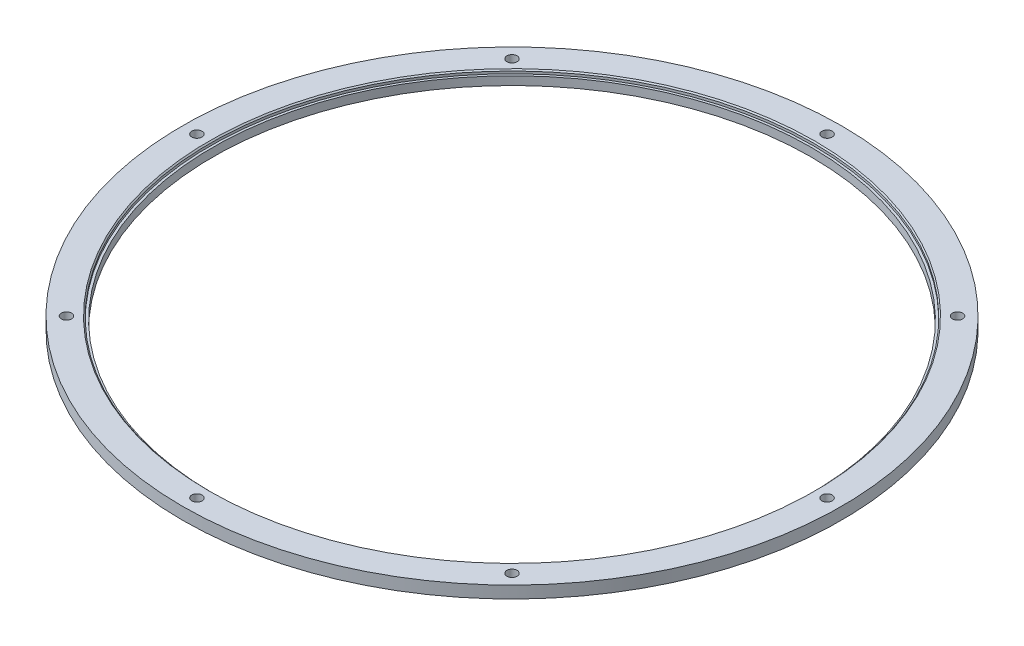
ISO-10303-21;
HEADER;
FILE_DESCRIPTION(('STEP AP214'),'2;1');
FILE_NAME('part.step','',(''),(''),'','','');
FILE_SCHEMA(('AUTOMOTIVE_DESIGN { 1 0 10303 214 1 1 1 1 }'));
ENDSEC;
DATA;
#1=APPLICATION_CONTEXT('core data for automotive mechanical design processes');
#2=APPLICATION_PROTOCOL_DEFINITION('international standard','automotive_design',2000,#1);
#3=PRODUCT_CONTEXT('',#1,'mechanical');
#4=PRODUCT('Part','Part','',(#3));
#5=PRODUCT_RELATED_PRODUCT_CATEGORY('part','',(#4));
#6=PRODUCT_DEFINITION_FORMATION('','',#4);
#7=PRODUCT_DEFINITION_CONTEXT('part definition',#1,'design');
#8=PRODUCT_DEFINITION('design','',#6,#7);
#9=PRODUCT_DEFINITION_SHAPE('','',#8);
#10=(LENGTH_UNIT() NAMED_UNIT(*) SI_UNIT(.MILLI.,.METRE.));
#11=(NAMED_UNIT(*) PLANE_ANGLE_UNIT() SI_UNIT($,.RADIAN.));
#12=(NAMED_UNIT(*) SI_UNIT($,.STERADIAN.) SOLID_ANGLE_UNIT());
#13=UNCERTAINTY_MEASURE_WITH_UNIT(LENGTH_MEASURE(1.E-05),#10,'distance_accuracy_value','');
#14=(GEOMETRIC_REPRESENTATION_CONTEXT(3) GLOBAL_UNCERTAINTY_ASSIGNED_CONTEXT((#13)) GLOBAL_UNIT_ASSIGNED_CONTEXT((#10,
#11,#12)) REPRESENTATION_CONTEXT('',''));
#15=CARTESIAN_POINT('',(0.,0.,0.));
#16=DIRECTION('',(0.,0.,1.));
#17=DIRECTION('',(1.,0.,0.));
#18=AXIS2_PLACEMENT_3D('',#15,#16,#17);
#19=CARTESIAN_POINT('',(0.,10.,0.));
#20=DIRECTION('',(0.,-1.,0.));
#21=DIRECTION('',(0.,0.,-1.));
#22=AXIS2_PLACEMENT_3D('',#19,#20,#21);
#23=CYLINDRICAL_SURFACE('',#22,248.);
#24=CARTESIAN_POINT('',(0.,0.,0.));
#25=DIRECTION('',(0.,1.,0.));
#26=DIRECTION('',(0.,0.,1.));
#27=AXIS2_PLACEMENT_3D('',#24,#25,#26);
#28=CIRCLE('',#27,248.);
#29=CARTESIAN_POINT('',(0.,0.,248.));
#30=VERTEX_POINT('',#29);
#31=EDGE_CURVE('E63',#30,#30,#28,.T.);
#32=ORIENTED_EDGE('',*,*,#31,.F.);
#33=EDGE_LOOP('',(#32));
#34=FACE_BOUND('',#33,.T.);
#35=CARTESIAN_POINT('',(0.,7.,0.));
#36=DIRECTION('',(0.,1.,0.));
#37=DIRECTION('',(0.,0.,1.));
#38=AXIS2_PLACEMENT_3D('',#35,#36,#37);
#39=CIRCLE('',#38,248.);
#40=CARTESIAN_POINT('',(0.,7.,248.));
#41=VERTEX_POINT('',#40);
#42=EDGE_CURVE('E57',#41,#41,#39,.T.);
#43=ORIENTED_EDGE('',*,*,#42,.T.);
#44=EDGE_LOOP('',(#43));
#45=FACE_BOUND('',#44,.T.);
#46=ADVANCED_FACE('F39',(#34,#45),#23,.F.);
#47=CARTESIAN_POINT('',(0.,10.,0.));
#48=DIRECTION('',(0.,1.,0.));
#49=DIRECTION('',(0.,0.,1.));
#50=AXIS2_PLACEMENT_3D('',#47,#48,#49);
#51=PLANE('',#50);
#52=CARTESIAN_POINT('',(0.,10.,0.));
#53=DIRECTION('',(0.,1.,0.));
#54=DIRECTION('',(0.,0.,1.));
#55=AXIS2_PLACEMENT_3D('',#52,#53,#54);
#56=CIRCLE('',#55,251.);
#57=CARTESIAN_POINT('',(0.,10.,251.));
#58=VERTEX_POINT('',#57);
#59=EDGE_CURVE('E10',#58,#58,#56,.F.);
#60=ORIENTED_EDGE('',*,*,#59,.T.);
#61=EDGE_LOOP('',(#60));
#62=FACE_BOUND('',#61,.T.);
#63=CARTESIAN_POINT('',(-260.999999999971,10.,2.86353058293568E-11));
#64=DIRECTION('',(0.,1.,0.));
#65=DIRECTION('',(0.,0.,1.));
#66=AXIS2_PLACEMENT_3D('',#63,#64,#65);
#67=CIRCLE('',#66,4.24999999999995);
#68=CARTESIAN_POINT('',(-260.999999999971,10.,4.25000000002859));
#69=VERTEX_POINT('',#68);
#70=EDGE_CURVE('E101',#69,#69,#67,.T.);
#71=ORIENTED_EDGE('',*,*,#70,.F.);
#72=EDGE_LOOP('',(#71));
#73=FACE_BOUND('',#72,.T.);
#74=CARTESIAN_POINT('',(5.72066850957982E-11,10.,261.));
#75=DIRECTION('',(0.,1.,0.));
#76=DIRECTION('',(0.,0.,1.));
#77=AXIS2_PLACEMENT_3D('',#74,#75,#76);
#78=CIRCLE('',#77,4.25);
#79=CARTESIAN_POINT('',(5.72066850957982E-11,10.,265.25));
#80=VERTEX_POINT('',#79);
#81=EDGE_CURVE('E89',#80,#80,#78,.T.);
#82=ORIENTED_EDGE('',*,*,#81,.F.);
#83=EDGE_LOOP('',(#82));
#84=FACE_BOUND('',#83,.T.);
#85=CARTESIAN_POINT('',(261.000000000029,10.,-2.86033425478991E-11));
#86=DIRECTION('',(0.,1.,0.));
#87=DIRECTION('',(0.,0.,1.));
#88=AXIS2_PLACEMENT_3D('',#85,#86,#87);
#89=CIRCLE('',#88,4.24999999999995);
#90=CARTESIAN_POINT('',(261.000000000029,10.,4.24999999997135));
#91=VERTEX_POINT('',#90);
#92=EDGE_CURVE('E77',#91,#91,#89,.T.);
#93=ORIENTED_EDGE('',*,*,#92,.F.);
#94=EDGE_LOOP('',(#93));
#95=FACE_BOUND('',#94,.T.);
#96=CARTESIAN_POINT('',(0.,10.,-261.));
#97=DIRECTION('',(0.,1.,0.));
#98=DIRECTION('',(0.,0.,1.));
#99=AXIS2_PLACEMENT_3D('',#96,#97,#98);
#100=CIRCLE('',#99,4.25);
#101=CARTESIAN_POINT('',(0.,10.,-256.75));
#102=VERTEX_POINT('',#101);
#103=EDGE_CURVE('E67',#102,#102,#100,.T.);
#104=ORIENTED_EDGE('',*,*,#103,.F.);
#105=EDGE_LOOP('',(#104));
#106=FACE_BOUND('',#105,.T.);
#107=CARTESIAN_POINT('',(0.,10.,0.));
#108=DIRECTION('',(0.,1.,0.));
#109=DIRECTION('',(0.,0.,1.));
#110=AXIS2_PLACEMENT_3D('',#107,#108,#109);
#111=CIRCLE('',#110,273.);
#112=CARTESIAN_POINT('',(0.,10.,273.));
#113=VERTEX_POINT('',#112);
#114=EDGE_CURVE('E50',#113,#113,#111,.T.);
#115=ORIENTED_EDGE('',*,*,#114,.T.);
#116=EDGE_LOOP('',(#115));
#117=FACE_BOUND('',#116,.T.);
#118=CARTESIAN_POINT('',(184.554869889697,10.,-184.554869889709));
#119=DIRECTION('',(0.,1.,0.));
#120=DIRECTION('',(0.,0.,1.));
#121=AXIS2_PLACEMENT_3D('',#118,#119,#120);
#122=CIRCLE('',#121,4.25000000000001);
#123=CARTESIAN_POINT('',(184.554869889697,10.,-180.304869889709));
#124=VERTEX_POINT('',#123);
#125=EDGE_CURVE('E71',#124,#124,#122,.T.);
#126=ORIENTED_EDGE('',*,*,#125,.F.);
#127=EDGE_LOOP('',(#126));
#128=FACE_BOUND('',#127,.T.);
#129=CARTESIAN_POINT('',(184.554869889738,10.,184.554869889669));
#130=DIRECTION('',(0.,1.,0.));
#131=DIRECTION('',(0.,0.,1.));
#132=AXIS2_PLACEMENT_3D('',#129,#130,#131);
#133=CIRCLE('',#132,4.25000000000001);
#134=CARTESIAN_POINT('',(184.554869889738,10.,188.804869889669));
#135=VERTEX_POINT('',#134);
#136=EDGE_CURVE('E83',#135,#135,#133,.T.);
#137=ORIENTED_EDGE('',*,*,#136,.F.);
#138=EDGE_LOOP('',(#137));
#139=FACE_BOUND('',#138,.T.);
#140=CARTESIAN_POINT('',(-184.55486988964,10.,184.554869889709));
#141=DIRECTION('',(0.,1.,0.));
#142=DIRECTION('',(0.,0.,1.));
#143=AXIS2_PLACEMENT_3D('',#140,#141,#142);
#144=CIRCLE('',#143,4.25000000000001);
#145=CARTESIAN_POINT('',(-184.55486988964,10.,188.804869889709));
#146=VERTEX_POINT('',#145);
#147=EDGE_CURVE('E95',#146,#146,#144,.T.);
#148=ORIENTED_EDGE('',*,*,#147,.F.);
#149=EDGE_LOOP('',(#148));
#150=FACE_BOUND('',#149,.T.);
#151=CARTESIAN_POINT('',(-184.554869889681,10.,-184.554869889669));
#152=DIRECTION('',(0.,1.,0.));
#153=DIRECTION('',(0.,0.,1.));
#154=AXIS2_PLACEMENT_3D('',#151,#152,#153);
#155=CIRCLE('',#154,4.25000000000001);
#156=CARTESIAN_POINT('',(-184.554869889681,10.,-180.304869889669));
#157=VERTEX_POINT('',#156);
#158=EDGE_CURVE('E107',#157,#157,#155,.T.);
#159=ORIENTED_EDGE('',*,*,#158,.F.);
#160=EDGE_LOOP('',(#159));
#161=FACE_BOUND('',#160,.T.);
#162=ADVANCED_FACE('F133',(#62,#73,#84,#95,#106,#117,#128,#139,#150,#161),#51,.T.);
#163=CARTESIAN_POINT('',(0.,0.,0.));
#164=DIRECTION('',(0.,1.,0.));
#165=DIRECTION('',(0.,0.,1.));
#166=AXIS2_PLACEMENT_3D('',#163,#164,#165);
#167=PLANE('',#166);
#168=CARTESIAN_POINT('',(0.,0.,0.));
#169=DIRECTION('',(0.,1.,0.));
#170=DIRECTION('',(0.,0.,1.));
#171=AXIS2_PLACEMENT_3D('',#168,#169,#170);
#172=CIRCLE('',#171,273.);
#173=CARTESIAN_POINT('',(0.,0.,273.));
#174=VERTEX_POINT('',#173);
#175=EDGE_CURVE('E54',#174,#174,#172,.T.);
#176=ORIENTED_EDGE('',*,*,#175,.F.);
#177=EDGE_LOOP('',(#176));
#178=FACE_BOUND('',#177,.T.);
#179=ORIENTED_EDGE('',*,*,#31,.T.);
#180=EDGE_LOOP('',(#179));
#181=FACE_BOUND('',#180,.T.);
#182=CARTESIAN_POINT('',(0.,0.,-261.));
#183=DIRECTION('',(0.,1.,0.));
#184=DIRECTION('',(0.,0.,1.));
#185=AXIS2_PLACEMENT_3D('',#182,#183,#184);
#186=CIRCLE('',#185,4.25);
#187=CARTESIAN_POINT('',(0.,0.,-256.75));
#188=VERTEX_POINT('',#187);
#189=EDGE_CURVE('E68',#188,#188,#186,.T.);
#190=ORIENTED_EDGE('',*,*,#189,.T.);
#191=EDGE_LOOP('',(#190));
#192=FACE_BOUND('',#191,.T.);
#193=CARTESIAN_POINT('',(184.554869889697,0.,-184.554869889709));
#194=DIRECTION('',(0.,1.,0.));
#195=DIRECTION('',(0.,0.,1.));
#196=AXIS2_PLACEMENT_3D('',#193,#194,#195);
#197=CIRCLE('',#196,4.25000000000001);
#198=CARTESIAN_POINT('',(184.554869889697,0.,-180.304869889709));
#199=VERTEX_POINT('',#198);
#200=EDGE_CURVE('E74',#199,#199,#197,.T.);
#201=ORIENTED_EDGE('',*,*,#200,.T.);
#202=EDGE_LOOP('',(#201));
#203=FACE_BOUND('',#202,.T.);
#204=CARTESIAN_POINT('',(261.000000000029,0.,-2.86033425478991E-11));
#205=DIRECTION('',(0.,1.,0.));
#206=DIRECTION('',(0.,0.,1.));
#207=AXIS2_PLACEMENT_3D('',#204,#205,#206);
#208=CIRCLE('',#207,4.24999999999995);
#209=CARTESIAN_POINT('',(261.000000000029,0.,4.24999999997135));
#210=VERTEX_POINT('',#209);
#211=EDGE_CURVE('E80',#210,#210,#208,.T.);
#212=ORIENTED_EDGE('',*,*,#211,.T.);
#213=EDGE_LOOP('',(#212));
#214=FACE_BOUND('',#213,.T.);
#215=CARTESIAN_POINT('',(184.554869889738,0.,184.554869889669));
#216=DIRECTION('',(0.,1.,0.));
#217=DIRECTION('',(0.,0.,1.));
#218=AXIS2_PLACEMENT_3D('',#215,#216,#217);
#219=CIRCLE('',#218,4.25000000000001);
#220=CARTESIAN_POINT('',(184.554869889738,0.,188.804869889669));
#221=VERTEX_POINT('',#220);
#222=EDGE_CURVE('E86',#221,#221,#219,.T.);
#223=ORIENTED_EDGE('',*,*,#222,.T.);
#224=EDGE_LOOP('',(#223));
#225=FACE_BOUND('',#224,.T.);
#226=CARTESIAN_POINT('',(5.72066850957982E-11,0.,261.));
#227=DIRECTION('',(0.,1.,0.));
#228=DIRECTION('',(0.,0.,1.));
#229=AXIS2_PLACEMENT_3D('',#226,#227,#228);
#230=CIRCLE('',#229,4.25);
#231=CARTESIAN_POINT('',(5.72066850957982E-11,0.,265.25));
#232=VERTEX_POINT('',#231);
#233=EDGE_CURVE('E92',#232,#232,#230,.T.);
#234=ORIENTED_EDGE('',*,*,#233,.T.);
#235=EDGE_LOOP('',(#234));
#236=FACE_BOUND('',#235,.T.);
#237=CARTESIAN_POINT('',(-184.55486988964,0.,184.554869889709));
#238=DIRECTION('',(0.,1.,0.));
#239=DIRECTION('',(0.,0.,1.));
#240=AXIS2_PLACEMENT_3D('',#237,#238,#239);
#241=CIRCLE('',#240,4.25000000000001);
#242=CARTESIAN_POINT('',(-184.55486988964,0.,188.804869889709));
#243=VERTEX_POINT('',#242);
#244=EDGE_CURVE('E98',#243,#243,#241,.T.);
#245=ORIENTED_EDGE('',*,*,#244,.T.);
#246=EDGE_LOOP('',(#245));
#247=FACE_BOUND('',#246,.T.);
#248=CARTESIAN_POINT('',(-260.999999999971,0.,2.86353058293568E-11));
#249=DIRECTION('',(0.,1.,0.));
#250=DIRECTION('',(0.,0.,1.));
#251=AXIS2_PLACEMENT_3D('',#248,#249,#250);
#252=CIRCLE('',#251,4.24999999999995);
#253=CARTESIAN_POINT('',(-260.999999999971,0.,4.25000000002859));
#254=VERTEX_POINT('',#253);
#255=EDGE_CURVE('E104',#254,#254,#252,.T.);
#256=ORIENTED_EDGE('',*,*,#255,.T.);
#257=EDGE_LOOP('',(#256));
#258=FACE_BOUND('',#257,.T.);
#259=CARTESIAN_POINT('',(-184.554869889681,0.,-184.554869889669));
#260=DIRECTION('',(0.,1.,0.));
#261=DIRECTION('',(0.,0.,1.));
#262=AXIS2_PLACEMENT_3D('',#259,#260,#261);
#263=CIRCLE('',#262,4.25000000000001);
#264=CARTESIAN_POINT('',(-184.554869889681,0.,-180.304869889669));
#265=VERTEX_POINT('',#264);
#266=EDGE_CURVE('E60',#265,#265,#263,.T.);
#267=ORIENTED_EDGE('',*,*,#266,.T.);
#268=EDGE_LOOP('',(#267));
#269=FACE_BOUND('',#268,.T.);
#270=ADVANCED_FACE('F139',(#178,#181,#192,#203,#214,#225,#236,#247,#258,#269),#167,.F.);
#271=CARTESIAN_POINT('',(0.,10.,0.));
#272=DIRECTION('',(0.,-1.,0.));
#273=DIRECTION('',(0.,0.,-1.));
#274=AXIS2_PLACEMENT_3D('',#271,#272,#273);
#275=CYLINDRICAL_SURFACE('',#274,273.);
#276=ORIENTED_EDGE('',*,*,#114,.F.);
#277=EDGE_LOOP('',(#276));
#278=FACE_BOUND('',#277,.T.);
#279=ORIENTED_EDGE('',*,*,#175,.T.);
#280=EDGE_LOOP('',(#279));
#281=FACE_BOUND('',#280,.T.);
#282=ADVANCED_FACE('F148',(#278,#281),#275,.T.);
#283=CARTESIAN_POINT('',(0.,10.,-261.));
#284=DIRECTION('',(0.,-1.,0.));
#285=DIRECTION('',(0.,0.,-1.));
#286=AXIS2_PLACEMENT_3D('',#283,#284,#285);
#287=CYLINDRICAL_SURFACE('',#286,4.25);
#288=ORIENTED_EDGE('',*,*,#103,.T.);
#289=EDGE_LOOP('',(#288));
#290=FACE_BOUND('',#289,.T.);
#291=ORIENTED_EDGE('',*,*,#189,.F.);
#292=EDGE_LOOP('',(#291));
#293=FACE_BOUND('',#292,.T.);
#294=ADVANCED_FACE('F144',(#290,#293),#287,.F.);
#295=CARTESIAN_POINT('',(184.554869889697,10.,-184.554869889709));
#296=DIRECTION('',(0.,-1.,0.));
#297=DIRECTION('',(0.,0.,-1.));
#298=AXIS2_PLACEMENT_3D('',#295,#296,#297);
#299=CYLINDRICAL_SURFACE('',#298,4.25000000000001);
#300=ORIENTED_EDGE('',*,*,#125,.T.);
#301=EDGE_LOOP('',(#300));
#302=FACE_BOUND('',#301,.T.);
#303=ORIENTED_EDGE('',*,*,#200,.F.);
#304=EDGE_LOOP('',(#303));
#305=FACE_BOUND('',#304,.T.);
#306=ADVANCED_FACE('F155',(#302,#305),#299,.F.);
#307=CARTESIAN_POINT('',(261.000000000029,10.,-2.86033425478991E-11));
#308=DIRECTION('',(0.,-1.,0.));
#309=DIRECTION('',(0.,0.,-1.));
#310=AXIS2_PLACEMENT_3D('',#307,#308,#309);
#311=CYLINDRICAL_SURFACE('',#310,4.24999999999995);
#312=ORIENTED_EDGE('',*,*,#92,.T.);
#313=EDGE_LOOP('',(#312));
#314=FACE_BOUND('',#313,.T.);
#315=ORIENTED_EDGE('',*,*,#211,.F.);
#316=EDGE_LOOP('',(#315));
#317=FACE_BOUND('',#316,.T.);
#318=ADVANCED_FACE('F196',(#314,#317),#311,.F.);
#319=CARTESIAN_POINT('',(184.554869889738,10.,184.554869889669));
#320=DIRECTION('',(0.,-1.,0.));
#321=DIRECTION('',(0.,0.,-1.));
#322=AXIS2_PLACEMENT_3D('',#319,#320,#321);
#323=CYLINDRICAL_SURFACE('',#322,4.25000000000001);
#324=ORIENTED_EDGE('',*,*,#136,.T.);
#325=EDGE_LOOP('',(#324));
#326=FACE_BOUND('',#325,.T.);
#327=ORIENTED_EDGE('',*,*,#222,.F.);
#328=EDGE_LOOP('',(#327));
#329=FACE_BOUND('',#328,.T.);
#330=ADVANCED_FACE('F192',(#326,#329),#323,.F.);
#331=CARTESIAN_POINT('',(5.72066850957982E-11,10.,261.));
#332=DIRECTION('',(0.,-1.,0.));
#333=DIRECTION('',(0.,0.,-1.));
#334=AXIS2_PLACEMENT_3D('',#331,#332,#333);
#335=CYLINDRICAL_SURFACE('',#334,4.25);
#336=ORIENTED_EDGE('',*,*,#81,.T.);
#337=EDGE_LOOP('',(#336));
#338=FACE_BOUND('',#337,.T.);
#339=ORIENTED_EDGE('',*,*,#233,.F.);
#340=EDGE_LOOP('',(#339));
#341=FACE_BOUND('',#340,.T.);
#342=ADVANCED_FACE('F186',(#338,#341),#335,.F.);
#343=CARTESIAN_POINT('',(-184.55486988964,10.,184.554869889709));
#344=DIRECTION('',(0.,-1.,0.));
#345=DIRECTION('',(0.,0.,-1.));
#346=AXIS2_PLACEMENT_3D('',#343,#344,#345);
#347=CYLINDRICAL_SURFACE('',#346,4.25000000000001);
#348=ORIENTED_EDGE('',*,*,#147,.T.);
#349=EDGE_LOOP('',(#348));
#350=FACE_BOUND('',#349,.T.);
#351=ORIENTED_EDGE('',*,*,#244,.F.);
#352=EDGE_LOOP('',(#351));
#353=FACE_BOUND('',#352,.T.);
#354=ADVANCED_FACE('F180',(#350,#353),#347,.F.);
#355=CARTESIAN_POINT('',(-260.999999999971,10.,2.86353058293568E-11));
#356=DIRECTION('',(0.,-1.,0.));
#357=DIRECTION('',(0.,0.,-1.));
#358=AXIS2_PLACEMENT_3D('',#355,#356,#357);
#359=CYLINDRICAL_SURFACE('',#358,4.24999999999995);
#360=ORIENTED_EDGE('',*,*,#70,.T.);
#361=EDGE_LOOP('',(#360));
#362=FACE_BOUND('',#361,.T.);
#363=ORIENTED_EDGE('',*,*,#255,.F.);
#364=EDGE_LOOP('',(#363));
#365=FACE_BOUND('',#364,.T.);
#366=ADVANCED_FACE('F129',(#362,#365),#359,.F.);
#367=CARTESIAN_POINT('',(-184.554869889681,10.,-184.554869889669));
#368=DIRECTION('',(0.,-1.,0.));
#369=DIRECTION('',(0.,0.,-1.));
#370=AXIS2_PLACEMENT_3D('',#367,#368,#369);
#371=CYLINDRICAL_SURFACE('',#370,4.25000000000001);
#372=ORIENTED_EDGE('',*,*,#158,.T.);
#373=EDGE_LOOP('',(#372));
#374=FACE_BOUND('',#373,.T.);
#375=ORIENTED_EDGE('',*,*,#266,.F.);
#376=EDGE_LOOP('',(#375));
#377=FACE_BOUND('',#376,.T.);
#378=ADVANCED_FACE('F121',(#374,#377),#371,.F.);
#379=CARTESIAN_POINT('',(0.,7.,0.));
#380=DIRECTION('',(0.,1.,0.));
#381=DIRECTION('',(0.,0.,1.));
#382=AXIS2_PLACEMENT_3D('',#379,#380,#381);
#383=CYLINDRICAL_SURFACE('',#382,250.);
#384=CARTESIAN_POINT('',(0.,8.99999999999992,0.));
#385=DIRECTION('',(0.,1.,0.));
#386=DIRECTION('',(0.,0.,1.));
#387=AXIS2_PLACEMENT_3D('',#384,#385,#386);
#388=CIRCLE('',#387,250.);
#389=CARTESIAN_POINT('',(0.,8.99999999999992,250.));
#390=VERTEX_POINT('',#389);
#391=EDGE_CURVE('E46',#390,#390,#388,.T.);
#392=ORIENTED_EDGE('',*,*,#391,.T.);
#393=EDGE_LOOP('',(#392));
#394=FACE_BOUND('',#393,.T.);
#395=CARTESIAN_POINT('',(0.,7.,0.));
#396=DIRECTION('',(0.,1.,0.));
#397=DIRECTION('',(0.,0.,1.));
#398=AXIS2_PLACEMENT_3D('',#395,#396,#397);
#399=CIRCLE('',#398,250.);
#400=CARTESIAN_POINT('',(0.,7.,250.));
#401=VERTEX_POINT('',#400);
#402=EDGE_CURVE('E61',#401,#401,#399,.T.);
#403=ORIENTED_EDGE('',*,*,#402,.F.);
#404=EDGE_LOOP('',(#403));
#405=FACE_BOUND('',#404,.T.);
#406=ADVANCED_FACE('F119',(#394,#405),#383,.F.);
#407=CARTESIAN_POINT('',(0.,7.,0.));
#408=DIRECTION('',(0.,1.,0.));
#409=DIRECTION('',(0.,0.,1.));
#410=AXIS2_PLACEMENT_3D('',#407,#408,#409);
#411=PLANE('',#410);
#412=ORIENTED_EDGE('',*,*,#42,.F.);
#413=EDGE_LOOP('',(#412));
#414=FACE_BOUND('',#413,.T.);
#415=ORIENTED_EDGE('',*,*,#402,.T.);
#416=EDGE_LOOP('',(#415));
#417=FACE_BOUND('',#416,.T.);
#418=ADVANCED_FACE('F117',(#414,#417),#411,.T.);
#419=CARTESIAN_POINT('',(0.,8.99999999999992,0.));
#420=DIRECTION('',(0.,1.,0.));
#421=DIRECTION('',(0.,0.,1.));
#422=AXIS2_PLACEMENT_3D('',#419,#420,#421);
#423=CONICAL_SURFACE('',#422,250.,0.785398163397462);
#424=ORIENTED_EDGE('',*,*,#59,.F.);
#425=EDGE_LOOP('',(#424));
#426=FACE_BOUND('',#425,.T.);
#427=ORIENTED_EDGE('',*,*,#391,.F.);
#428=EDGE_LOOP('',(#427));
#429=FACE_BOUND('',#428,.T.);
#430=ADVANCED_FACE('F41',(#426,#429),#423,.F.);
#431=CLOSED_SHELL('',(#46,#162,#270,#282,#294,#306,#318,#330,#342,#354,#366,#378,#406,#418,#430));
#432=MANIFOLD_SOLID_BREP('B2',#431);
#433=ADVANCED_BREP_SHAPE_REPRESENTATION('',(#18,#432),#14);
#434=SHAPE_DEFINITION_REPRESENTATION(#9,#433);
ENDSEC;
END-ISO-10303-21;
